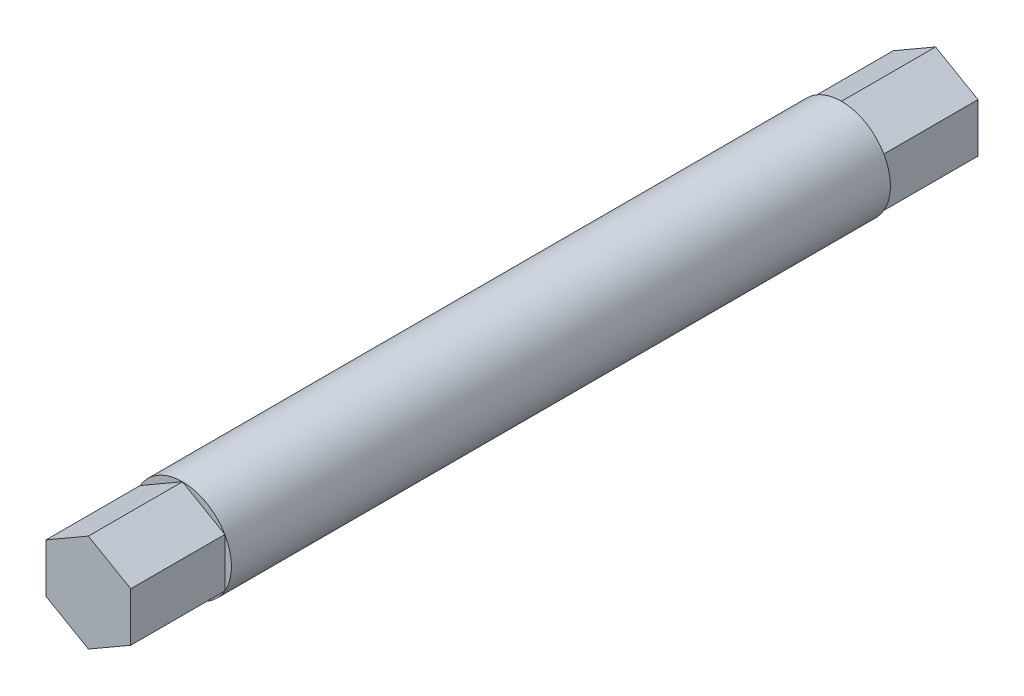
ISO-10303-21;
HEADER;
FILE_DESCRIPTION(('STEP AP214'),'2;1');
FILE_NAME('part.step','',(''),(''),'','','');
FILE_SCHEMA(('AUTOMOTIVE_DESIGN { 1 0 10303 214 1 1 1 1 }'));
ENDSEC;
DATA;
#1=APPLICATION_CONTEXT('core data for automotive mechanical design processes');
#2=APPLICATION_PROTOCOL_DEFINITION('international standard','automotive_design',2000,#1);
#3=PRODUCT_CONTEXT('',#1,'mechanical');
#4=PRODUCT('Part','Part','',(#3));
#5=PRODUCT_RELATED_PRODUCT_CATEGORY('part','',(#4));
#6=PRODUCT_DEFINITION_FORMATION('','',#4);
#7=PRODUCT_DEFINITION_CONTEXT('part definition',#1,'design');
#8=PRODUCT_DEFINITION('design','',#6,#7);
#9=PRODUCT_DEFINITION_SHAPE('','',#8);
#10=(LENGTH_UNIT() NAMED_UNIT(*) SI_UNIT(.MILLI.,.METRE.));
#11=(NAMED_UNIT(*) PLANE_ANGLE_UNIT() SI_UNIT($,.RADIAN.));
#12=(NAMED_UNIT(*) SI_UNIT($,.STERADIAN.) SOLID_ANGLE_UNIT());
#13=UNCERTAINTY_MEASURE_WITH_UNIT(LENGTH_MEASURE(1.E-05),#10,'distance_accuracy_value','');
#14=(GEOMETRIC_REPRESENTATION_CONTEXT(3) GLOBAL_UNCERTAINTY_ASSIGNED_CONTEXT((#13)) GLOBAL_UNIT_ASSIGNED_CONTEXT((#10,
#11,#12)) REPRESENTATION_CONTEXT('',''));
#15=CARTESIAN_POINT('',(0.,0.,0.));
#16=DIRECTION('',(0.,0.,1.));
#17=DIRECTION('',(1.,0.,0.));
#18=AXIS2_PLACEMENT_3D('',#15,#16,#17);
#19=CARTESIAN_POINT('',(0.,0.,80.));
#20=DIRECTION('',(0.,0.,1.));
#21=DIRECTION('',(1.,0.,0.));
#22=AXIS2_PLACEMENT_3D('',#19,#20,#21);
#23=PLANE('',#22);
#24=DIRECTION('',(-0.866025403784442,0.499999999999995,0.));
#25=VECTOR('',#24,1.);
#26=CARTESIAN_POINT('',(4.49999999999997,2.59807621135337,80.));
#27=LINE('',#26,#25);
#28=CARTESIAN_POINT('',(4.49999999999997,2.59807621135337,80.));
#29=VERTEX_POINT('',#28);
#30=CARTESIAN_POINT('',(0.,5.19615242270664,80.));
#31=VERTEX_POINT('',#30);
#32=EDGE_CURVE('E147',#29,#31,#27,.T.);
#33=ORIENTED_EDGE('',*,*,#32,.F.);
#34=CARTESIAN_POINT('',(0.,0.,80.));
#35=DIRECTION('',(0.,0.,1.));
#36=DIRECTION('',(1.,0.,0.));
#37=AXIS2_PLACEMENT_3D('',#34,#35,#36);
#38=CIRCLE('',#37,5.19615242270664);
#39=EDGE_CURVE('E158',#29,#31,#38,.T.);
#40=ORIENTED_EDGE('',*,*,#39,.T.);
#41=EDGE_LOOP('',(#33,#40));
#42=FACE_BOUND('',#41,.T.);
#43=ADVANCED_FACE('F33',(#42),#23,.T.);
#44=DIRECTION('',(0.,1.,0.));
#45=VECTOR('',#44,1.);
#46=CARTESIAN_POINT('',(4.50000000000003,-2.59807621135328,80.));
#47=LINE('',#46,#45);
#48=CARTESIAN_POINT('',(4.50000000000003,-2.59807621135328,80.));
#49=VERTEX_POINT('',#48);
#50=EDGE_CURVE('E47',#49,#29,#47,.T.);
#51=ORIENTED_EDGE('',*,*,#50,.F.);
#52=EDGE_CURVE('E162',#49,#29,#38,.T.);
#53=ORIENTED_EDGE('',*,*,#52,.T.);
#54=EDGE_LOOP('',(#51,#53));
#55=FACE_BOUND('',#54,.T.);
#56=ADVANCED_FACE('F260',(#55),#23,.T.);
#57=DIRECTION('',(0.866025403784435,0.500000000000007,0.));
#58=VECTOR('',#57,1.);
#59=CARTESIAN_POINT('',(0.,-5.19615242270664,80.));
#60=LINE('',#59,#58);
#61=CARTESIAN_POINT('',(0.,-5.19615242270664,80.));
#62=VERTEX_POINT('',#61);
#63=EDGE_CURVE('E54',#62,#49,#60,.T.);
#64=ORIENTED_EDGE('',*,*,#63,.F.);
#65=EDGE_CURVE('E520',#62,#49,#38,.T.);
#66=ORIENTED_EDGE('',*,*,#65,.T.);
#67=EDGE_LOOP('',(#64,#66));
#68=FACE_BOUND('',#67,.T.);
#69=ADVANCED_FACE('F266',(#68),#23,.T.);
#70=DIRECTION('',(0.866025403784441,-0.499999999999995,0.));
#71=VECTOR('',#70,1.);
#72=CARTESIAN_POINT('',(-4.49999999999999,-2.59807621135334,80.));
#73=LINE('',#72,#71);
#74=CARTESIAN_POINT('',(-4.49999999999999,-2.59807621135334,80.));
#75=VERTEX_POINT('',#74);
#76=EDGE_CURVE('E296',#75,#62,#73,.T.);
#77=ORIENTED_EDGE('',*,*,#76,.F.);
#78=EDGE_CURVE('E518',#75,#62,#38,.T.);
#79=ORIENTED_EDGE('',*,*,#78,.T.);
#80=EDGE_LOOP('',(#77,#79));
#81=FACE_BOUND('',#80,.T.);
#82=ADVANCED_FACE('F278',(#81),#23,.T.);
#83=DIRECTION('',(0.,-1.,0.));
#84=VECTOR('',#83,1.);
#85=CARTESIAN_POINT('',(-4.50000000000001,2.59807621135331,80.));
#86=LINE('',#85,#84);
#87=CARTESIAN_POINT('',(-4.50000000000001,2.59807621135331,80.));
#88=VERTEX_POINT('',#87);
#89=EDGE_CURVE('E290',#88,#75,#86,.T.);
#90=ORIENTED_EDGE('',*,*,#89,.F.);
#91=EDGE_CURVE('E292',#88,#75,#38,.T.);
#92=ORIENTED_EDGE('',*,*,#91,.T.);
#93=EDGE_LOOP('',(#90,#92));
#94=FACE_BOUND('',#93,.T.);
#95=ADVANCED_FACE('F270',(#94),#23,.T.);
#96=CARTESIAN_POINT('',(4.49999999999997,2.59807621135337,10.));
#97=DIRECTION('',(-0.499999999999995,-0.866025403784442,0.));
#98=DIRECTION('',(0.866025403784442,-0.499999999999995,0.));
#99=AXIS2_PLACEMENT_3D('',#96,#97,#98);
#100=PLANE('',#99);
#101=DIRECTION('',(-0.866025403784441,0.499999999999995,0.));
#102=VECTOR('',#101,1.);
#103=CARTESIAN_POINT('',(4.49999999999997,2.59807621135337,0.));
#104=LINE('',#103,#102);
#105=CARTESIAN_POINT('',(4.49999999999997,2.59807621135337,0.));
#106=VERTEX_POINT('',#105);
#107=CARTESIAN_POINT('',(0.,5.19615242270664,0.));
#108=VERTEX_POINT('',#107);
#109=EDGE_CURVE('E160',#106,#108,#104,.T.);
#110=ORIENTED_EDGE('',*,*,#109,.T.);
#111=DIRECTION('',(0.,0.,-1.));
#112=VECTOR('',#111,1.);
#113=CARTESIAN_POINT('',(0.,5.19615242270664,10.));
#114=LINE('',#113,#112);
#115=CARTESIAN_POINT('',(0.,5.19615242270664,10.));
#116=VERTEX_POINT('',#115);
#117=EDGE_CURVE('E11',#116,#108,#114,.T.);
#118=ORIENTED_EDGE('',*,*,#117,.F.);
#119=DIRECTION('',(-0.866025403784441,0.499999999999995,0.));
#120=VECTOR('',#119,1.);
#121=CARTESIAN_POINT('',(4.49999999999997,2.59807621135337,10.));
#122=LINE('',#121,#120);
#123=CARTESIAN_POINT('',(4.49999999999997,2.59807621135337,10.));
#124=VERTEX_POINT('',#123);
#125=EDGE_CURVE('E166',#124,#116,#122,.T.);
#126=ORIENTED_EDGE('',*,*,#125,.F.);
#127=DIRECTION('',(0.,0.,-1.));
#128=VECTOR('',#127,1.);
#129=CARTESIAN_POINT('',(4.49999999999997,2.59807621135337,10.));
#130=LINE('',#129,#128);
#131=EDGE_CURVE('E185',#124,#106,#130,.T.);
#132=ORIENTED_EDGE('',*,*,#131,.T.);
#133=EDGE_LOOP('',(#110,#118,#126,#132));
#134=FACE_BOUND('',#133,.T.);
#135=ADVANCED_FACE('F35',(#134),#100,.F.);
#136=CARTESIAN_POINT('',(0.,5.19615242270664,10.));
#137=DIRECTION('',(0.500000000000001,-0.866025403784438,0.));
#138=DIRECTION('',(0.866025403784438,0.500000000000001,0.));
#139=AXIS2_PLACEMENT_3D('',#136,#137,#138);
#140=PLANE('',#139);
#141=DIRECTION('',(-0.866025403784438,-0.500000000000001,0.));
#142=VECTOR('',#141,1.);
#143=CARTESIAN_POINT('',(0.,5.19615242270664,0.));
#144=LINE('',#143,#142);
#145=CARTESIAN_POINT('',(-4.50000000000001,2.59807621135331,0.));
#146=VERTEX_POINT('',#145);
#147=EDGE_CURVE('E188',#108,#146,#144,.T.);
#148=ORIENTED_EDGE('',*,*,#147,.T.);
#149=DIRECTION('',(0.,0.,-1.));
#150=VECTOR('',#149,1.);
#151=CARTESIAN_POINT('',(-4.50000000000001,2.59807621135331,10.));
#152=LINE('',#151,#150);
#153=CARTESIAN_POINT('',(-4.50000000000001,2.59807621135331,10.));
#154=VERTEX_POINT('',#153);
#155=EDGE_CURVE('E41',#154,#146,#152,.T.);
#156=ORIENTED_EDGE('',*,*,#155,.F.);
#157=DIRECTION('',(-0.866025403784438,-0.500000000000001,0.));
#158=VECTOR('',#157,1.);
#159=CARTESIAN_POINT('',(0.,5.19615242270664,10.));
#160=LINE('',#159,#158);
#161=EDGE_CURVE('E169',#116,#154,#160,.T.);
#162=ORIENTED_EDGE('',*,*,#161,.F.);
#163=ORIENTED_EDGE('',*,*,#117,.T.);
#164=EDGE_LOOP('',(#148,#156,#162,#163));
#165=FACE_BOUND('',#164,.T.);
#166=ADVANCED_FACE('F284',(#165),#140,.F.);
#167=CARTESIAN_POINT('',(-4.50000000000001,2.59807621135331,10.));
#168=DIRECTION('',(1.,0.,0.));
#169=DIRECTION('',(0.,1.,0.));
#170=AXIS2_PLACEMENT_3D('',#167,#168,#169);
#171=PLANE('',#170);
#172=DIRECTION('',(0.,-1.,0.));
#173=VECTOR('',#172,1.);
#174=CARTESIAN_POINT('',(-4.50000000000001,2.59807621135331,0.));
#175=LINE('',#174,#173);
#176=CARTESIAN_POINT('',(-4.49999999999999,-2.59807621135334,0.));
#177=VERTEX_POINT('',#176);
#178=EDGE_CURVE('E190',#146,#177,#175,.T.);
#179=ORIENTED_EDGE('',*,*,#178,.T.);
#180=DIRECTION('',(0.,0.,-1.));
#181=VECTOR('',#180,1.);
#182=CARTESIAN_POINT('',(-4.49999999999999,-2.59807621135334,10.));
#183=LINE('',#182,#181);
#184=CARTESIAN_POINT('',(-4.49999999999999,-2.59807621135334,10.));
#185=VERTEX_POINT('',#184);
#186=EDGE_CURVE('E205',#185,#177,#183,.T.);
#187=ORIENTED_EDGE('',*,*,#186,.F.);
#188=DIRECTION('',(0.,-1.,0.));
#189=VECTOR('',#188,1.);
#190=CARTESIAN_POINT('',(-4.50000000000001,2.59807621135331,10.));
#191=LINE('',#190,#189);
#192=EDGE_CURVE('E173',#154,#185,#191,.T.);
#193=ORIENTED_EDGE('',*,*,#192,.F.);
#194=ORIENTED_EDGE('',*,*,#155,.T.);
#195=EDGE_LOOP('',(#179,#187,#193,#194));
#196=FACE_BOUND('',#195,.T.);
#197=ADVANCED_FACE('F211',(#196),#171,.F.);
#198=CARTESIAN_POINT('',(-4.49999999999999,-2.59807621135334,10.));
#199=DIRECTION('',(0.499999999999995,0.866025403784442,0.));
#200=DIRECTION('',(-0.866025403784442,0.499999999999995,0.));
#201=AXIS2_PLACEMENT_3D('',#198,#199,#200);
#202=PLANE('',#201);
#203=DIRECTION('',(0.866025403784442,-0.499999999999995,0.));
#204=VECTOR('',#203,1.);
#205=CARTESIAN_POINT('',(-4.49999999999999,-2.59807621135334,0.));
#206=LINE('',#205,#204);
#207=CARTESIAN_POINT('',(0.,-5.19615242270664,0.));
#208=VERTEX_POINT('',#207);
#209=EDGE_CURVE('E192',#177,#208,#206,.T.);
#210=ORIENTED_EDGE('',*,*,#209,.T.);
#211=DIRECTION('',(0.,0.,-1.));
#212=VECTOR('',#211,1.);
#213=CARTESIAN_POINT('',(0.,-5.19615242270664,10.));
#214=LINE('',#213,#212);
#215=CARTESIAN_POINT('',(0.,-5.19615242270664,10.));
#216=VERTEX_POINT('',#215);
#217=EDGE_CURVE('E202',#216,#208,#214,.T.);
#218=ORIENTED_EDGE('',*,*,#217,.F.);
#219=DIRECTION('',(0.866025403784442,-0.499999999999995,0.));
#220=VECTOR('',#219,1.);
#221=CARTESIAN_POINT('',(-4.49999999999999,-2.59807621135334,10.));
#222=LINE('',#221,#220);
#223=EDGE_CURVE('E176',#185,#216,#222,.T.);
#224=ORIENTED_EDGE('',*,*,#223,.F.);
#225=ORIENTED_EDGE('',*,*,#186,.T.);
#226=EDGE_LOOP('',(#210,#218,#224,#225));
#227=FACE_BOUND('',#226,.T.);
#228=ADVANCED_FACE('F220',(#227),#202,.F.);
#229=CARTESIAN_POINT('',(0.,-5.19615242270664,10.));
#230=DIRECTION('',(-0.500000000000007,0.866025403784434,0.));
#231=DIRECTION('',(-0.866025403784435,-0.500000000000007,0.));
#232=AXIS2_PLACEMENT_3D('',#229,#230,#231);
#233=PLANE('',#232);
#234=DIRECTION('',(0.866025403784434,0.500000000000007,0.));
#235=VECTOR('',#234,1.);
#236=CARTESIAN_POINT('',(0.,-5.19615242270664,0.));
#237=LINE('',#236,#235);
#238=CARTESIAN_POINT('',(4.50000000000003,-2.59807621135328,0.));
#239=VERTEX_POINT('',#238);
#240=EDGE_CURVE('E194',#208,#239,#237,.T.);
#241=ORIENTED_EDGE('',*,*,#240,.T.);
#242=DIRECTION('',(0.,0.,-1.));
#243=VECTOR('',#242,1.);
#244=CARTESIAN_POINT('',(4.50000000000003,-2.59807621135328,10.));
#245=LINE('',#244,#243);
#246=CARTESIAN_POINT('',(4.50000000000003,-2.59807621135328,10.));
#247=VERTEX_POINT('',#246);
#248=EDGE_CURVE('E199',#247,#239,#245,.T.);
#249=ORIENTED_EDGE('',*,*,#248,.F.);
#250=DIRECTION('',(0.866025403784434,0.500000000000007,0.));
#251=VECTOR('',#250,1.);
#252=CARTESIAN_POINT('',(0.,-5.19615242270664,10.));
#253=LINE('',#252,#251);
#254=EDGE_CURVE('E179',#216,#247,#253,.T.);
#255=ORIENTED_EDGE('',*,*,#254,.F.);
#256=ORIENTED_EDGE('',*,*,#217,.T.);
#257=EDGE_LOOP('',(#241,#249,#255,#256));
#258=FACE_BOUND('',#257,.T.);
#259=ADVANCED_FACE('F224',(#258),#233,.F.);
#260=CARTESIAN_POINT('',(4.50000000000003,-2.59807621135328,10.));
#261=DIRECTION('',(-1.,0.,0.));
#262=DIRECTION('',(0.,-1.,0.));
#263=AXIS2_PLACEMENT_3D('',#260,#261,#262);
#264=PLANE('',#263);
#265=DIRECTION('',(0.,1.,0.));
#266=VECTOR('',#265,1.);
#267=CARTESIAN_POINT('',(4.50000000000003,-2.59807621135328,0.));
#268=LINE('',#267,#266);
#269=EDGE_CURVE('E170',#239,#106,#268,.T.);
#270=ORIENTED_EDGE('',*,*,#269,.T.);
#271=ORIENTED_EDGE('',*,*,#131,.F.);
#272=DIRECTION('',(0.,1.,0.));
#273=VECTOR('',#272,1.);
#274=CARTESIAN_POINT('',(4.50000000000003,-2.59807621135328,10.));
#275=LINE('',#274,#273);
#276=EDGE_CURVE('E182',#247,#124,#275,.T.);
#277=ORIENTED_EDGE('',*,*,#276,.F.);
#278=ORIENTED_EDGE('',*,*,#248,.T.);
#279=EDGE_LOOP('',(#270,#271,#277,#278));
#280=FACE_BOUND('',#279,.T.);
#281=ADVANCED_FACE('F459',(#280),#264,.F.);
#282=CARTESIAN_POINT('',(0.,0.,0.));
#283=DIRECTION('',(0.,0.,1.));
#284=DIRECTION('',(1.,0.,0.));
#285=AXIS2_PLACEMENT_3D('',#282,#283,#284);
#286=PLANE('',#285);
#287=ORIENTED_EDGE('',*,*,#109,.F.);
#288=ORIENTED_EDGE('',*,*,#269,.F.);
#289=ORIENTED_EDGE('',*,*,#240,.F.);
#290=ORIENTED_EDGE('',*,*,#209,.F.);
#291=ORIENTED_EDGE('',*,*,#178,.F.);
#292=ORIENTED_EDGE('',*,*,#147,.F.);
#293=EDGE_LOOP('',(#287,#288,#289,#290,#291,#292));
#294=FACE_BOUND('',#293,.T.);
#295=ADVANCED_FACE('F216',(#294),#286,.F.);
#296=CARTESIAN_POINT('',(0.,0.,10.));
#297=DIRECTION('',(0.,0.,1.));
#298=DIRECTION('',(1.,0.,0.));
#299=AXIS2_PLACEMENT_3D('',#296,#297,#298);
#300=PLANE('',#299);
#301=CARTESIAN_POINT('',(0.,0.,10.));
#302=DIRECTION('',(0.,0.,1.));
#303=DIRECTION('',(1.,0.,0.));
#304=AXIS2_PLACEMENT_3D('',#301,#302,#303);
#305=CIRCLE('',#304,5.19615242270664);
#306=EDGE_CURVE('E153',#124,#116,#305,.T.);
#307=ORIENTED_EDGE('',*,*,#306,.F.);
#308=ORIENTED_EDGE('',*,*,#125,.T.);
#309=EDGE_LOOP('',(#307,#308));
#310=FACE_BOUND('',#309,.T.);
#311=ADVANCED_FACE('F255',(#310),#300,.F.);
#312=EDGE_CURVE('E165',#116,#154,#305,.T.);
#313=ORIENTED_EDGE('',*,*,#312,.F.);
#314=ORIENTED_EDGE('',*,*,#161,.T.);
#315=EDGE_LOOP('',(#313,#314));
#316=FACE_BOUND('',#315,.T.);
#317=ADVANCED_FACE('F245',(#316),#300,.F.);
#318=EDGE_CURVE('E241',#154,#185,#305,.T.);
#319=ORIENTED_EDGE('',*,*,#318,.F.);
#320=ORIENTED_EDGE('',*,*,#192,.T.);
#321=EDGE_LOOP('',(#319,#320));
#322=FACE_BOUND('',#321,.T.);
#323=ADVANCED_FACE('F248',(#322),#300,.F.);
#324=EDGE_CURVE('E233',#185,#216,#305,.T.);
#325=ORIENTED_EDGE('',*,*,#324,.F.);
#326=ORIENTED_EDGE('',*,*,#223,.T.);
#327=EDGE_LOOP('',(#325,#326));
#328=FACE_BOUND('',#327,.T.);
#329=ADVANCED_FACE('F231',(#328),#300,.F.);
#330=EDGE_CURVE('E151',#216,#247,#305,.T.);
#331=ORIENTED_EDGE('',*,*,#330,.F.);
#332=ORIENTED_EDGE('',*,*,#254,.T.);
#333=EDGE_LOOP('',(#331,#332));
#334=FACE_BOUND('',#333,.T.);
#335=ADVANCED_FACE('F236',(#334),#300,.F.);
#336=CARTESIAN_POINT('',(0.,0.,80.));
#337=DIRECTION('',(0.,0.,-1.));
#338=DIRECTION('',(-1.,0.,0.));
#339=AXIS2_PLACEMENT_3D('',#336,#337,#338);
#340=CYLINDRICAL_SURFACE('',#339,5.19615242270664);
#341=ORIENTED_EDGE('',*,*,#39,.F.);
#342=ORIENTED_EDGE('',*,*,#52,.F.);
#343=ORIENTED_EDGE('',*,*,#65,.F.);
#344=ORIENTED_EDGE('',*,*,#78,.F.);
#345=ORIENTED_EDGE('',*,*,#91,.F.);
#346=EDGE_CURVE('E161',#31,#88,#38,.T.);
#347=ORIENTED_EDGE('',*,*,#346,.F.);
#348=EDGE_LOOP('',(#341,#342,#343,#344,#345,#347));
#349=FACE_BOUND('',#348,.T.);
#350=ORIENTED_EDGE('',*,*,#306,.T.);
#351=ORIENTED_EDGE('',*,*,#312,.T.);
#352=ORIENTED_EDGE('',*,*,#318,.T.);
#353=ORIENTED_EDGE('',*,*,#324,.T.);
#354=ORIENTED_EDGE('',*,*,#330,.T.);
#355=EDGE_CURVE('E148',#247,#124,#305,.T.);
#356=ORIENTED_EDGE('',*,*,#355,.T.);
#357=EDGE_LOOP('',(#350,#351,#352,#353,#354,#356));
#358=FACE_BOUND('',#357,.T.);
#359=ADVANCED_FACE('F238',(#349,#358),#340,.T.);
#360=DIRECTION('',(-0.866025403784438,-0.500000000000001,0.));
#361=VECTOR('',#360,1.);
#362=CARTESIAN_POINT('',(0.,5.19615242270664,80.));
#363=LINE('',#362,#361);
#364=EDGE_CURVE('E297',#31,#88,#363,.T.);
#365=ORIENTED_EDGE('',*,*,#364,.F.);
#366=ORIENTED_EDGE('',*,*,#346,.T.);
#367=EDGE_LOOP('',(#365,#366));
#368=FACE_BOUND('',#367,.T.);
#369=ADVANCED_FACE('F262',(#368),#23,.T.);
#370=ORIENTED_EDGE('',*,*,#355,.F.);
#371=ORIENTED_EDGE('',*,*,#276,.T.);
#372=EDGE_LOOP('',(#370,#371));
#373=FACE_BOUND('',#372,.T.);
#374=ADVANCED_FACE('F256',(#373),#300,.F.);
#375=CARTESIAN_POINT('',(4.49999999999997,2.59807621135337,90.));
#376=DIRECTION('',(-0.499999999999995,-0.866025403784442,0.));
#377=DIRECTION('',(0.866025403784442,-0.499999999999995,0.));
#378=AXIS2_PLACEMENT_3D('',#375,#376,#377);
#379=PLANE('',#378);
#380=ORIENTED_EDGE('',*,*,#32,.T.);
#381=DIRECTION('',(0.,0.,-1.));
#382=VECTOR('',#381,1.);
#383=CARTESIAN_POINT('',(0.,5.19615242270664,90.));
#384=LINE('',#383,#382);
#385=CARTESIAN_POINT('',(0.,5.19615242270664,90.));
#386=VERTEX_POINT('',#385);
#387=EDGE_CURVE('E129',#386,#31,#384,.T.);
#388=ORIENTED_EDGE('',*,*,#387,.F.);
#389=DIRECTION('',(-0.866025403784442,0.499999999999995,0.));
#390=VECTOR('',#389,1.);
#391=CARTESIAN_POINT('',(4.49999999999997,2.59807621135337,90.));
#392=LINE('',#391,#390);
#393=CARTESIAN_POINT('',(4.49999999999997,2.59807621135337,90.));
#394=VERTEX_POINT('',#393);
#395=EDGE_CURVE('E136',#394,#386,#392,.T.);
#396=ORIENTED_EDGE('',*,*,#395,.F.);
#397=DIRECTION('',(0.,0.,-1.));
#398=VECTOR('',#397,1.);
#399=CARTESIAN_POINT('',(4.49999999999997,2.59807621135337,90.));
#400=LINE('',#399,#398);
#401=EDGE_CURVE('E310',#394,#29,#400,.T.);
#402=ORIENTED_EDGE('',*,*,#401,.T.);
#403=EDGE_LOOP('',(#380,#388,#396,#402));
#404=FACE_BOUND('',#403,.T.);
#405=ADVANCED_FACE('F146',(#404),#379,.F.);
#406=CARTESIAN_POINT('',(0.,5.19615242270664,90.));
#407=DIRECTION('',(0.500000000000001,-0.866025403784438,0.));
#408=DIRECTION('',(0.866025403784438,0.500000000000001,0.));
#409=AXIS2_PLACEMENT_3D('',#406,#407,#408);
#410=PLANE('',#409);
#411=ORIENTED_EDGE('',*,*,#364,.T.);
#412=DIRECTION('',(0.,0.,-1.));
#413=VECTOR('',#412,1.);
#414=CARTESIAN_POINT('',(-4.50000000000001,2.59807621135331,90.));
#415=LINE('',#414,#413);
#416=CARTESIAN_POINT('',(-4.50000000000001,2.59807621135331,90.));
#417=VERTEX_POINT('',#416);
#418=EDGE_CURVE('E132',#417,#88,#415,.T.);
#419=ORIENTED_EDGE('',*,*,#418,.F.);
#420=DIRECTION('',(-0.866025403784438,-0.500000000000001,0.));
#421=VECTOR('',#420,1.);
#422=CARTESIAN_POINT('',(0.,5.19615242270664,90.));
#423=LINE('',#422,#421);
#424=EDGE_CURVE('E124',#386,#417,#423,.T.);
#425=ORIENTED_EDGE('',*,*,#424,.F.);
#426=ORIENTED_EDGE('',*,*,#387,.T.);
#427=EDGE_LOOP('',(#411,#419,#425,#426));
#428=FACE_BOUND('',#427,.T.);
#429=ADVANCED_FACE('F127',(#428),#410,.F.);
#430=CARTESIAN_POINT('',(-4.50000000000001,2.59807621135331,90.));
#431=DIRECTION('',(1.,0.,0.));
#432=DIRECTION('',(0.,1.,0.));
#433=AXIS2_PLACEMENT_3D('',#430,#431,#432);
#434=PLANE('',#433);
#435=ORIENTED_EDGE('',*,*,#89,.T.);
#436=DIRECTION('',(0.,0.,-1.));
#437=VECTOR('',#436,1.);
#438=CARTESIAN_POINT('',(-4.49999999999999,-2.59807621135334,90.));
#439=LINE('',#438,#437);
#440=CARTESIAN_POINT('',(-4.49999999999999,-2.59807621135334,90.));
#441=VERTEX_POINT('',#440);
#442=EDGE_CURVE('E154',#441,#75,#439,.T.);
#443=ORIENTED_EDGE('',*,*,#442,.F.);
#444=DIRECTION('',(0.,-1.,0.));
#445=VECTOR('',#444,1.);
#446=CARTESIAN_POINT('',(-4.50000000000001,2.59807621135331,90.));
#447=LINE('',#446,#445);
#448=EDGE_CURVE('E135',#417,#441,#447,.T.);
#449=ORIENTED_EDGE('',*,*,#448,.F.);
#450=ORIENTED_EDGE('',*,*,#418,.T.);
#451=EDGE_LOOP('',(#435,#443,#449,#450));
#452=FACE_BOUND('',#451,.T.);
#453=ADVANCED_FACE('F301',(#452),#434,.F.);
#454=CARTESIAN_POINT('',(-4.49999999999999,-2.59807621135334,90.));
#455=DIRECTION('',(0.499999999999995,0.866025403784442,0.));
#456=DIRECTION('',(-0.866025403784442,0.499999999999995,0.));
#457=AXIS2_PLACEMENT_3D('',#454,#455,#456);
#458=PLANE('',#457);
#459=ORIENTED_EDGE('',*,*,#76,.T.);
#460=DIRECTION('',(0.,0.,-1.));
#461=VECTOR('',#460,1.);
#462=CARTESIAN_POINT('',(0.,-5.19615242270664,90.));
#463=LINE('',#462,#461);
#464=CARTESIAN_POINT('',(0.,-5.19615242270664,90.));
#465=VERTEX_POINT('',#464);
#466=EDGE_CURVE('E320',#465,#62,#463,.T.);
#467=ORIENTED_EDGE('',*,*,#466,.F.);
#468=DIRECTION('',(0.866025403784441,-0.499999999999995,0.));
#469=VECTOR('',#468,1.);
#470=CARTESIAN_POINT('',(-4.49999999999999,-2.59807621135334,90.));
#471=LINE('',#470,#469);
#472=EDGE_CURVE('E303',#441,#465,#471,.T.);
#473=ORIENTED_EDGE('',*,*,#472,.F.);
#474=ORIENTED_EDGE('',*,*,#442,.T.);
#475=EDGE_LOOP('',(#459,#467,#473,#474));
#476=FACE_BOUND('',#475,.T.);
#477=ADVANCED_FACE('F323',(#476),#458,.F.);
#478=CARTESIAN_POINT('',(0.,-5.19615242270664,90.));
#479=DIRECTION('',(-0.500000000000007,0.866025403784434,0.));
#480=DIRECTION('',(-0.866025403784435,-0.500000000000007,0.));
#481=AXIS2_PLACEMENT_3D('',#478,#479,#480);
#482=PLANE('',#481);
#483=ORIENTED_EDGE('',*,*,#63,.T.);
#484=DIRECTION('',(0.,0.,-1.));
#485=VECTOR('',#484,1.);
#486=CARTESIAN_POINT('',(4.50000000000003,-2.59807621135328,90.));
#487=LINE('',#486,#485);
#488=CARTESIAN_POINT('',(4.50000000000003,-2.59807621135328,90.));
#489=VERTEX_POINT('',#488);
#490=EDGE_CURVE('E317',#489,#49,#487,.T.);
#491=ORIENTED_EDGE('',*,*,#490,.F.);
#492=DIRECTION('',(0.866025403784435,0.500000000000007,0.));
#493=VECTOR('',#492,1.);
#494=CARTESIAN_POINT('',(0.,-5.19615242270664,90.));
#495=LINE('',#494,#493);
#496=EDGE_CURVE('E305',#465,#489,#495,.T.);
#497=ORIENTED_EDGE('',*,*,#496,.F.);
#498=ORIENTED_EDGE('',*,*,#466,.T.);
#499=EDGE_LOOP('',(#483,#491,#497,#498));
#500=FACE_BOUND('',#499,.T.);
#501=ADVANCED_FACE('F328',(#500),#482,.F.);
#502=CARTESIAN_POINT('',(4.50000000000003,-2.59807621135328,90.));
#503=DIRECTION('',(-1.,0.,0.));
#504=DIRECTION('',(0.,-1.,0.));
#505=AXIS2_PLACEMENT_3D('',#502,#503,#504);
#506=PLANE('',#505);
#507=ORIENTED_EDGE('',*,*,#50,.T.);
#508=ORIENTED_EDGE('',*,*,#401,.F.);
#509=DIRECTION('',(0.,1.,0.));
#510=VECTOR('',#509,1.);
#511=CARTESIAN_POINT('',(4.50000000000003,-2.59807621135328,90.));
#512=LINE('',#511,#510);
#513=EDGE_CURVE('E141',#489,#394,#512,.T.);
#514=ORIENTED_EDGE('',*,*,#513,.F.);
#515=ORIENTED_EDGE('',*,*,#490,.T.);
#516=EDGE_LOOP('',(#507,#508,#514,#515));
#517=FACE_BOUND('',#516,.T.);
#518=ADVANCED_FACE('F330',(#517),#506,.F.);
#519=CARTESIAN_POINT('',(0.,0.,90.));
#520=DIRECTION('',(0.,0.,1.));
#521=DIRECTION('',(1.,0.,0.));
#522=AXIS2_PLACEMENT_3D('',#519,#520,#521);
#523=PLANE('',#522);
#524=ORIENTED_EDGE('',*,*,#395,.T.);
#525=ORIENTED_EDGE('',*,*,#424,.T.);
#526=ORIENTED_EDGE('',*,*,#448,.T.);
#527=ORIENTED_EDGE('',*,*,#472,.T.);
#528=ORIENTED_EDGE('',*,*,#496,.T.);
#529=ORIENTED_EDGE('',*,*,#513,.T.);
#530=EDGE_LOOP('',(#524,#525,#526,#527,#528,#529));
#531=FACE_BOUND('',#530,.T.);
#532=ADVANCED_FACE('F139',(#531),#523,.T.);
#533=CLOSED_SHELL('',(#43,#56,#69,#82,#95,#135,#166,#197,#228,#259,#281,#295,#311,#317,#323,
#329,#335,#359,#369,#374,#405,#429,#453,#477,#501,#518,#532));
#534=MANIFOLD_SOLID_BREP('B2',#533);
#535=ADVANCED_BREP_SHAPE_REPRESENTATION('',(#18,#534),#14);
#536=SHAPE_DEFINITION_REPRESENTATION(#9,#535);
ENDSEC;
END-ISO-10303-21;
